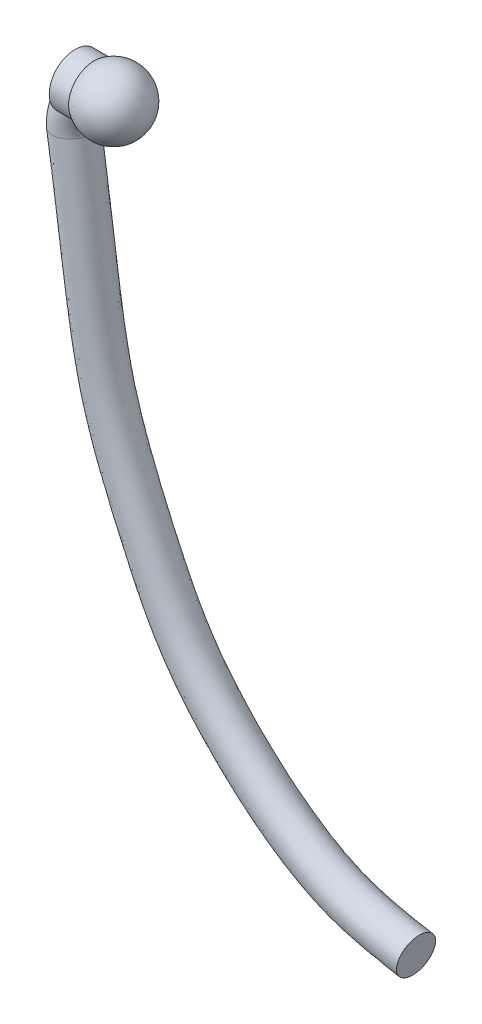
ISO-10303-21;
HEADER;
FILE_DESCRIPTION(('STEP AP214'),'2;1');
FILE_NAME('part.step','',(''),(''),'','','');
FILE_SCHEMA(('AUTOMOTIVE_DESIGN { 1 0 10303 214 1 1 1 1 }'));
ENDSEC;
DATA;
#1=APPLICATION_CONTEXT('core data for automotive mechanical design processes');
#2=APPLICATION_PROTOCOL_DEFINITION('international standard','automotive_design',2000,#1);
#3=PRODUCT_CONTEXT('',#1,'mechanical');
#4=PRODUCT('Part','Part','',(#3));
#5=PRODUCT_RELATED_PRODUCT_CATEGORY('part','',(#4));
#6=PRODUCT_DEFINITION_FORMATION('','',#4);
#7=PRODUCT_DEFINITION_CONTEXT('part definition',#1,'design');
#8=PRODUCT_DEFINITION('design','',#6,#7);
#9=PRODUCT_DEFINITION_SHAPE('','',#8);
#10=(LENGTH_UNIT() NAMED_UNIT(*) SI_UNIT(.MILLI.,.METRE.));
#11=(NAMED_UNIT(*) PLANE_ANGLE_UNIT() SI_UNIT($,.RADIAN.));
#12=(NAMED_UNIT(*) SI_UNIT($,.STERADIAN.) SOLID_ANGLE_UNIT());
#13=UNCERTAINTY_MEASURE_WITH_UNIT(LENGTH_MEASURE(1.E-05),#10,'distance_accuracy_value','');
#14=(GEOMETRIC_REPRESENTATION_CONTEXT(3) GLOBAL_UNCERTAINTY_ASSIGNED_CONTEXT((#13)) GLOBAL_UNIT_ASSIGNED_CONTEXT((#10,
#11,#12)) REPRESENTATION_CONTEXT('',''));
#15=CARTESIAN_POINT('',(0.,0.,0.));
#16=DIRECTION('',(0.,0.,1.));
#17=DIRECTION('',(1.,0.,0.));
#18=AXIS2_PLACEMENT_3D('',#15,#16,#17);
#19=CARTESIAN_POINT('',(-0.0106926166099035,0.,-0.15));
#20=CARTESIAN_POINT('',(-0.0274696503355554,0.,-0.15));
#21=CARTESIAN_POINT('',(-0.0601594618193001,-0.00304024673754914,-0.15));
#22=CARTESIAN_POINT('',(-0.11357903975813,-0.0174072750003002,-0.15));
#23=CARTESIAN_POINT('',(-0.163959337655345,-0.040864326922888,-0.15));
#24=CARTESIAN_POINT('',(-0.210750071659686,-0.0740666282199939,-0.15));
#25=CARTESIAN_POINT('',(-0.247646717062509,-0.113236952224477,-0.15));
#26=CARTESIAN_POINT('',(-0.277855380696539,-0.161394430237348,-0.15));
#27=CARTESIAN_POINT('',(-0.298187605453956,-0.211953645073237,-0.15));
#28=CARTESIAN_POINT('',(-0.309623406786862,-0.264715976755664,-0.15));
#29=CARTESIAN_POINT('',(-0.311129569039642,-0.297025149708893,-0.15));
#30=CARTESIAN_POINT('',(-0.31038974592792,-0.313477042648187,-0.15));
#31=CARTESIAN_POINT('',(-0.0106926166099035,0.3,-0.15));
#32=CARTESIAN_POINT('',(-0.0274696503355554,0.3,-0.15));
#33=CARTESIAN_POINT('',(-0.125351922333396,0.293260602950491,-0.15));
#34=CARTESIAN_POINT('',(-0.218277020498136,0.264437042215253,-0.15));
#35=CARTESIAN_POINT('',(-0.320307921228764,0.217669897199567,-0.15));
#36=CARTESIAN_POINT('',(-0.414103780964583,0.149427702048361,-0.15));
#37=CARTESIAN_POINT('',(-0.492748355596244,0.0634662388382427,-0.15));
#38=CARTESIAN_POINT('',(-0.55211438170516,-0.0344868074002096,-0.15));
#39=CARTESIAN_POINT('',(-0.589812372961597,-0.137857370007301,-0.15));
#40=CARTESIAN_POINT('',(-0.611320534229493,-0.23046459167502,-0.15));
#41=CARTESIAN_POINT('',(-0.610076906112513,-0.327175774931569,-0.15));
#42=CARTESIAN_POINT('',(-0.609337083000791,-0.343627667870862,-0.15));
#43=CARTESIAN_POINT('',(-0.0106926166099035,0.3,0.15));
#44=CARTESIAN_POINT('',(-0.0274696503355554,0.3,0.15));
#45=CARTESIAN_POINT('',(-0.125351922333396,0.293260602950491,0.15));
#46=CARTESIAN_POINT('',(-0.218277020498136,0.264437042215253,0.15));
#47=CARTESIAN_POINT('',(-0.320307921228764,0.217669897199567,0.15));
#48=CARTESIAN_POINT('',(-0.414103780964583,0.149427702048361,0.15));
#49=CARTESIAN_POINT('',(-0.492748355596244,0.0634662388382427,0.15));
#50=CARTESIAN_POINT('',(-0.55211438170516,-0.0344868074002096,0.15));
#51=CARTESIAN_POINT('',(-0.589812372961597,-0.137857370007301,0.15));
#52=CARTESIAN_POINT('',(-0.611320534229493,-0.23046459167502,0.15));
#53=CARTESIAN_POINT('',(-0.610076906112513,-0.327175774931569,0.15));
#54=CARTESIAN_POINT('',(-0.609337083000791,-0.343627667870862,0.15));
#55=CARTESIAN_POINT('',(-0.0106926166099035,0.,0.15));
#56=CARTESIAN_POINT('',(-0.0274696503355554,0.,0.15));
#57=CARTESIAN_POINT('',(-0.0601594618193001,-0.00304024673754912,0.15));
#58=CARTESIAN_POINT('',(-0.11357903975813,-0.0174072750003002,0.15));
#59=CARTESIAN_POINT('',(-0.163959337655345,-0.040864326922888,0.15));
#60=CARTESIAN_POINT('',(-0.210750071659686,-0.0740666282199939,0.15));
#61=CARTESIAN_POINT('',(-0.247646717062509,-0.113236952224477,0.15));
#62=CARTESIAN_POINT('',(-0.27785538069654,-0.161394430237348,0.15));
#63=CARTESIAN_POINT('',(-0.298187605453956,-0.211953645073238,0.15));
#64=CARTESIAN_POINT('',(-0.309623406786862,-0.264715976755664,0.15));
#65=CARTESIAN_POINT('',(-0.311129569039642,-0.297025149708893,0.15));
#66=CARTESIAN_POINT('',(-0.31038974592792,-0.313477042648187,0.15));
#67=CARTESIAN_POINT('',(-0.0106926166099035,-0.3,0.15));
#68=CARTESIAN_POINT('',(-0.0274696503355554,-0.3,0.15));
#69=CARTESIAN_POINT('',(0.00503299869479531,-0.299341096425589,0.15));
#70=CARTESIAN_POINT('',(-0.00888105901812529,-0.299251592215854,0.15));
#71=CARTESIAN_POINT('',(-0.00761075408192601,-0.299398551045343,0.15));
#72=CARTESIAN_POINT('',(-0.00739636235478842,-0.297560958488348,0.15));
#73=CARTESIAN_POINT('',(-0.00254507852877501,-0.289940143287197,0.15));
#74=CARTESIAN_POINT('',(-0.00359637968791915,-0.288302053074486,0.15));
#75=CARTESIAN_POINT('',(-0.00656283794631473,-0.286049920139174,0.15));
#76=CARTESIAN_POINT('',(-0.00792627934423149,-0.298967361836307,0.15));
#77=CARTESIAN_POINT('',(-0.0121822319667709,-0.266874524486218,0.15));
#78=CARTESIAN_POINT('',(-0.0114424088550488,-0.283326417425511,0.15));
#79=CARTESIAN_POINT('',(-0.0106926166099035,-0.3,-0.15));
#80=CARTESIAN_POINT('',(-0.0274696503355554,-0.3,-0.15));
#81=CARTESIAN_POINT('',(0.00503299869479531,-0.299341096425589,-0.15));
#82=CARTESIAN_POINT('',(-0.00888105901812529,-0.299251592215854,-0.15));
#83=CARTESIAN_POINT('',(-0.00761075408192601,-0.299398551045343,-0.15));
#84=CARTESIAN_POINT('',(-0.00739636235478842,-0.297560958488348,-0.15));
#85=CARTESIAN_POINT('',(-0.00254507852877501,-0.289940143287197,-0.15));
#86=CARTESIAN_POINT('',(-0.00359637968791915,-0.288302053074486,-0.15));
#87=CARTESIAN_POINT('',(-0.00656283794631473,-0.286049920139174,-0.15));
#88=CARTESIAN_POINT('',(-0.00792627934423149,-0.298967361836307,-0.15));
#89=CARTESIAN_POINT('',(-0.0121822319667709,-0.266874524486218,-0.15));
#90=CARTESIAN_POINT('',(-0.0114424088550488,-0.283326417425511,-0.15));
#91=CARTESIAN_POINT('',(-0.0106926166099035,0.,-0.15));
#92=CARTESIAN_POINT('',(-0.0274696503355554,0.,-0.15));
#93=CARTESIAN_POINT('',(-0.0601594618193001,-0.00304024673754914,-0.15));
#94=CARTESIAN_POINT('',(-0.11357903975813,-0.0174072750003002,-0.15));
#95=CARTESIAN_POINT('',(-0.163959337655345,-0.040864326922888,-0.15));
#96=CARTESIAN_POINT('',(-0.210750071659686,-0.0740666282199939,-0.15));
#97=CARTESIAN_POINT('',(-0.247646717062509,-0.113236952224477,-0.15));
#98=CARTESIAN_POINT('',(-0.277855380696539,-0.161394430237348,-0.15));
#99=CARTESIAN_POINT('',(-0.298187605453956,-0.211953645073237,-0.15));
#100=CARTESIAN_POINT('',(-0.309623406786862,-0.264715976755664,-0.15));
#101=CARTESIAN_POINT('',(-0.311129569039642,-0.297025149708893,-0.15));
#102=CARTESIAN_POINT('',(-0.31038974592792,-0.313477042648187,-0.15));
#103=(BOUNDED_SURFACE() B_SPLINE_SURFACE(3,3,((#19,#20,#21,#22,#23,#24,#25,#26,#27,#28,#29,#30),
(#31,#32,#33,#34,#35,#36,#37,#38,#39,#40,#41,#42),(#43,#44,#45,#46,#47,#48,#49,#50,#51,#52,#53,
#54),(#55,#56,#57,#58,#59,#60,#61,#62,#63,#64,#65,#66),(#67,#68,#69,#70,#71,#72,#73,#74,#75,#76,
#77,#78),(#79,#80,#81,#82,#83,#84,#85,#86,#87,#88,#89,#90),(#91,#92,#93,#94,#95,#96,#97,#98,#99,
#100,#101,#102)),.UNSPECIFIED.,.T.,.F.,.F.) B_SPLINE_SURFACE_WITH_KNOTS((4,3,4),(4,1,1,1,1,1,1,
1,1,4),(0.,0.5,1.),(0.,0.107382273943545,0.214616989416298,0.325775449425742,0.442043019539431,
0.564335874067141,0.67830105457525,0.787849250029312,0.894017072188608,1.),
.UNSPECIFIED.) GEOMETRIC_REPRESENTATION_ITEM() RATIONAL_B_SPLINE_SURFACE(((1.,1.,1.,1.,1.,1.,1.,
1.,1.,1.,1.,1.),(0.333333333333333,0.333333333333333,0.333333333333333,0.333333333333333,
0.333333333333333,0.333333333333333,0.333333333333333,0.333333333333333,0.333333333333333,
0.333333333333333,0.333333333333333,0.333333333333333),(0.333333333333333,0.333333333333333,
0.333333333333333,0.333333333333333,0.333333333333333,0.333333333333333,0.333333333333333,
0.333333333333333,0.333333333333333,0.333333333333333,0.333333333333333,0.333333333333333),(1.,
1.,1.,1.,1.,1.,1.,1.,1.,1.,1.,1.),(0.333333333333333,0.333333333333333,0.333333333333333,
0.333333333333333,0.333333333333333,0.333333333333333,0.333333333333333,0.333333333333333,
0.333333333333333,0.333333333333333,0.333333333333333,0.333333333333333),(0.333333333333333,
0.333333333333333,0.333333333333333,0.333333333333333,0.333333333333333,0.333333333333333,
0.333333333333333,0.333333333333333,0.333333333333333,0.333333333333333,0.333333333333333,
0.333333333333333),(1.,1.,1.,1.,1.,1.,1.,1.,1.,1.,1.,1.))) REPRESENTATION_ITEM('') SURFACE());
#104=CARTESIAN_POINT('',(-0.299999999999686,-0.136331714618667,-0.146334082123994));
#105=CARTESIAN_POINT('',(-0.290863642355465,-0.1345844554364,-0.147932075160637));
#106=CARTESIAN_POINT('',(-0.281473155448432,-0.13333300350285,-0.149064620614882));
#107=CARTESIAN_POINT('',(-0.262480914951277,-0.132101423752771,-0.150175426210611));
#108=CARTESIAN_POINT('',(-0.252878107870872,-0.13213085032023,-0.150145011755781));
#109=CARTESIAN_POINT('',(-0.236805394896345,-0.133524050109138,-0.148900335304193));
#110=CARTESIAN_POINT('',(-0.230275131621225,-0.134477181214744,-0.148050802120753));
#111=CARTESIAN_POINT('',(-0.217548317450747,-0.137144600250954,-0.145584356724694));
#112=CARTESIAN_POINT('',(-0.211350456705265,-0.138855609688366,-0.143970747761315));
#113=CARTESIAN_POINT('',(-0.199440453568951,-0.142935101415709,-0.139920065923362));
#114=CARTESIAN_POINT('',(-0.193729587577499,-0.145305246020314,-0.137480907623022));
#115=CARTESIAN_POINT('',(-0.182947003817764,-0.15049040939449,-0.131786489102963));
#116=CARTESIAN_POINT('',(-0.177876421414653,-0.153306199015514,-0.128529808951271));
#117=CARTESIAN_POINT('',(-0.163767358046019,-0.162010706360538,-0.117630141372031));
#118=CARTESIAN_POINT('',(-0.155771753537615,-0.168181282981623,-0.108837063650234));
#119=CARTESIAN_POINT('',(-0.141530953219301,-0.180319249944901,-0.0875051531757729));
#120=CARTESIAN_POINT('',(-0.135700066190499,-0.186131159628033,-0.0746103353626214));
#121=CARTESIAN_POINT('',(-0.126734767590223,-0.195397914471497,-0.0455461331270798));
#122=CARTESIAN_POINT('',(-0.123931264598526,-0.198556243935249,-0.0291777167104979));
#123=CARTESIAN_POINT('',(-0.122040965043913,-0.200664899609103,0.00422700781479089));
#124=CARTESIAN_POINT('',(-0.122998280074614,-0.199565285468028,0.0212689077692113));
#125=CARTESIAN_POINT('',(-0.12873488790736,-0.193318490578605,0.0538467821271335));
#126=CARTESIAN_POINT('',(-0.133495565343796,-0.188191025981588,0.069389679082215));
#127=CARTESIAN_POINT('',(-0.143674081929535,-0.178595967468044,0.0903627361064858));
#128=CARTESIAN_POINT('',(-0.147604174620646,-0.175054778167521,0.0969942583166261));
#129=CARTESIAN_POINT('',(-0.156581495506477,-0.167661841132851,0.109270909335789));
#130=CARTESIAN_POINT('',(-0.16162830451373,-0.163810210274718,0.114916406854791));
#131=CARTESIAN_POINT('',(-0.172568330976763,-0.156448976343672,0.12473781304649));
#132=CARTESIAN_POINT('',(-0.178398408423533,-0.152932293020231,0.12897826357668));
#133=CARTESIAN_POINT('',(-0.191023950773728,-0.146466206459085,0.136277345206562));
#134=CARTESIAN_POINT('',(-0.197817283360246,-0.143515583227051,0.139338532597072));
#135=CARTESIAN_POINT('',(-0.211052889556991,-0.138938059781777,0.14389307359331));
#136=CARTESIAN_POINT('',(-0.217392497122094,-0.137178356796567,0.145553666322049));
#137=CARTESIAN_POINT('',(-0.230392573291752,-0.134451466217067,0.148074054557085));
#138=CARTESIAN_POINT('',(-0.23705341671717,-0.133485229351444,0.148932889567748));
#139=CARTESIAN_POINT('',(-0.260155185809829,-0.131543575049926,0.150674429757816));
#140=CARTESIAN_POINT('',(-0.276927127524948,-0.132540899396995,0.149826195277144));
#141=CARTESIAN_POINT('',(-0.295369177011944,-0.135487376346327,0.147115696669723));
#142=CARTESIAN_POINT('',(-0.297693262089106,-0.135894159182839,0.146740033243813));
#143=CARTESIAN_POINT('',(-0.300000000000453,-0.136331714607611,0.146334082127661));
#144=B_SPLINE_CURVE_WITH_KNOTS('',3,(#104,#105,#106,#107,#108,#109,#110,#111,#112,#113,#114,
#115,#116,#117,#118,#119,#120,#121,#122,#123,#124,#125,#126,#127,#128,#129,#130,#131,#132,#133,
#134,#135,#136,#137,#138,#139,#140,#141,#142,#143),.UNSPECIFIED.,.F.,.F.,(4,2,2,2,2,2,2,2,2,2,2,
2,2,2,2,2,2,2,2,4),(0.,0.0284102410315837,0.0570324370138274,0.076905201082822,
0.0966928249385212,0.116530812216742,0.136403496898723,0.175954780231196,0.221166776870093,
0.27093448820308,0.321287670545221,0.371395900612978,0.396738218154183,0.422071038910645,
0.445986759201024,0.469850341642783,0.490099580924274,0.510373047525644,0.559711175412683,
0.566874718983783),.UNSPECIFIED.);
#145=CARTESIAN_POINT('',(-0.3,-0.136331714607295,-0.146334082127715));
#146=VERTEX_POINT('',#145);
#147=CARTESIAN_POINT('',(-0.150000000012057,-0.173103640726156,-0.100175493846298));
#148=VERTEX_POINT('',#147);
#149=EDGE_CURVE('E51',#146,#148,#144,.T.);
#150=CARTESIAN_POINT('',(-0.180136517374345,-0.0925858020005814,-0.146556147520844));
#151=CARTESIAN_POINT('',(-0.177160223821154,-0.101401341167023,-0.144654585464569));
#152=CARTESIAN_POINT('',(-0.174157711007457,-0.110034114792797,-0.141959487608441));
#153=CARTESIAN_POINT('',(-0.168186070119803,-0.126707136061684,-0.135086204395576));
#154=CARTESIAN_POINT('',(-0.16521696346823,-0.134747020021021,-0.130907117736933));
#155=CARTESIAN_POINT('',(-0.159400714868007,-0.149998802529904,-0.121170607602066));
#156=CARTESIAN_POINT('',(-0.156553618554732,-0.157210392939353,-0.115612673583984));
#157=CARTESIAN_POINT('',(-0.151090716745326,-0.170586789949842,-0.103257084253783));
#158=CARTESIAN_POINT('',(-0.14847490465238,-0.176751626411592,-0.0964594643176156));
#159=CARTESIAN_POINT('',(-0.143684755761816,-0.187690904806338,-0.0819345308792571));
#160=CARTESIAN_POINT('',(-0.141501994559982,-0.19249287621642,-0.0742308779340528));
#161=CARTESIAN_POINT('',(-0.137708220743359,-0.200654451295558,-0.057969102691995));
#162=CARTESIAN_POINT('',(-0.136096435360126,-0.20401600575184,-0.0494121555270982));
#163=CARTESIAN_POINT('',(-0.133760690732441,-0.208832365058485,-0.0326508050646556));
#164=CARTESIAN_POINT('',(-0.132961081301,-0.21045075113008,-0.0245042482683785));
#165=CARTESIAN_POINT('',(-0.132049211088169,-0.212291856116223,-0.00802626311988404));
#166=CARTESIAN_POINT('',(-0.131936507212364,-0.212515474739849,0.000305042576185881));
#167=CARTESIAN_POINT('',(-0.132622151981437,-0.211140668897883,0.0234897779742567));
#168=CARTESIAN_POINT('',(-0.134216927016438,-0.207950574099344,0.0382570971468304));
#169=CARTESIAN_POINT('',(-0.139219501213331,-0.197455421916017,0.0660434859777733));
#170=CARTESIAN_POINT('',(-0.142652854152421,-0.190092278434849,0.0790345928136093));
#171=CARTESIAN_POINT('',(-0.150874991864004,-0.171215513700673,0.10344929772172));
#172=CARTESIAN_POINT('',(-0.155768927609801,-0.159344458015269,0.114560411013672));
#173=CARTESIAN_POINT('',(-0.16398672602771,-0.138048480645966,0.12906632809329));
#174=CARTESIAN_POINT('',(-0.16719003728461,-0.129440245296472,0.133785108819291));
#175=CARTESIAN_POINT('',(-0.173648872055548,-0.111492852936654,0.141496711428997));
#176=CARTESIAN_POINT('',(-0.176904429968452,-0.10215319723065,0.14448834386941));
#177=CARTESIAN_POINT('',(-0.180136517374313,-0.0925858020006532,0.146556147520827));
#178=B_SPLINE_CURVE_WITH_KNOTS('',3,(#150,#151,#152,#153,#154,#155,#156,#157,#158,#159,#160,
#161,#162,#163,#164,#165,#166,#167,#168,#169,#170,#171,#172,#173,#174,#175,#176,#177),
.UNSPECIFIED.,.F.,.F.,(4,2,2,2,2,2,2,2,2,2,2,2,2,4),(0.,0.0284533264523951,0.0569239636982982,
0.0854051584601809,0.113885540603517,0.141741272990282,0.169559159607244,0.194446112144242,
0.219317009435058,0.263980980942915,0.309282475911664,0.359389710228695,0.390214189311538,
0.421059871187897),.UNSPECIFIED.);
#179=CARTESIAN_POINT('',(-0.15,-0.173103640736441,0.100175493828527));
#180=VERTEX_POINT('',#179);
#181=EDGE_CURVE('E74',#148,#180,#178,.T.);
#182=CARTESIAN_POINT('',(-0.3,-0.136331714607562,0.14633408212772));
#183=VERTEX_POINT('',#182);
#184=EDGE_CURVE('E68',#180,#183,#144,.T.);
#185=CARTESIAN_POINT('',(-0.300000000000014,-0.202399999999996,-0.149872930608669));
#186=CARTESIAN_POINT('',(-0.300000000000005,-0.191516033986441,-0.149724008710005));
#187=CARTESIAN_POINT('',(-0.300000000000001,-0.180626229349511,-0.149444190094314));
#188=CARTESIAN_POINT('',(-0.299999999999998,-0.158736438444456,-0.148370387069068));
#189=CARTESIAN_POINT('',(-0.299999999999999,-0.147736791999471,-0.147569970922332));
#190=CARTESIAN_POINT('',(-0.300000000000001,-0.121462501220942,-0.144723297355984));
#191=CARTESIAN_POINT('',(-0.300000000000001,-0.106219856070111,-0.142309207914083));
#192=CARTESIAN_POINT('',(-0.299999999999999,-0.0763376641470669,-0.135210866958877));
#193=CARTESIAN_POINT('',(-0.299999999999997,-0.0616949759905368,-0.13054071722933));
#194=CARTESIAN_POINT('',(-0.299999999999997,-0.0309224431226903,-0.116933205705473));
#195=CARTESIAN_POINT('',(-0.299999999999999,-0.0150529200228886,-0.107345098650147));
#196=CARTESIAN_POINT('',(-0.3,0.0104602091268992,-0.0849634923856717));
#197=CARTESIAN_POINT('',(-0.3,0.0206803698164261,-0.0728654217112565));
#198=CARTESIAN_POINT('',(-0.3,0.0323187817545215,-0.0525481811787304));
#199=CARTESIAN_POINT('',(-0.3,0.0355902240989634,-0.045370567061368));
#200=CARTESIAN_POINT('',(-0.3,0.0406827737780192,-0.0305221764960874));
#201=CARTESIAN_POINT('',(-0.3,0.0425049634587401,-0.0228517727144995));
#202=CARTESIAN_POINT('',(-0.3,0.0452873346196284,-0.00155182705056789));
#203=CARTESIAN_POINT('',(-0.3,0.0446377801373459,0.0123262720306305));
#204=CARTESIAN_POINT('',(-0.3,0.0387667218811681,0.0383326679143764));
#205=CARTESIAN_POINT('',(-0.3,0.0337576335029705,0.0505121638981799));
#206=CARTESIAN_POINT('',(-0.3,0.0199907114066975,0.0734569428442876));
#207=CARTESIAN_POINT('',(-0.3,0.0110322733706816,0.0840992049388013));
#208=CARTESIAN_POINT('',(-0.3,-0.00639614000302605,0.0999546178537227));
#209=CARTESIAN_POINT('',(-0.3,-0.0142778154451443,0.105850666588182));
#210=CARTESIAN_POINT('',(-0.3,-0.0308961243243771,0.116292775230428));
#211=CARTESIAN_POINT('',(-0.299999999999999,-0.0396338755943888,0.120837037933269));
#212=CARTESIAN_POINT('',(-0.3,-0.0623283256424644,0.130734406183284));
#213=CARTESIAN_POINT('',(-0.300000000000003,-0.0766327006247933,0.135275812226016));
#214=CARTESIAN_POINT('',(-0.299999999999997,-0.10577981238435,0.142209830632203));
#215=CARTESIAN_POINT('',(-0.299999999999987,-0.120624981666207,0.144591034565171));
#216=CARTESIAN_POINT('',(-0.299999999999989,-0.146703223719817,0.14748615628219));
#217=CARTESIAN_POINT('',(-0.299999999999995,-0.157906015163985,0.148319033671786));
#218=CARTESIAN_POINT('',(-0.300000000000005,-0.180209023488198,0.149433497550648));
#219=CARTESIAN_POINT('',(-0.300000000000007,-0.191308897469137,0.149721451562793));
#220=CARTESIAN_POINT('',(-0.3,-0.2024,0.14987293060867));
#221=B_SPLINE_CURVE_WITH_KNOTS('',3,(#185,#186,#187,#188,#189,#190,#191,#192,#193,#194,#195,
#196,#197,#198,#199,#200,#201,#202,#203,#204,#205,#206,#207,#208,#209,#210,#211,#212,#213,#214,
#215,#216,#217,#218,#219,#220),.UNSPECIFIED.,.F.,.F.,(4,2,2,2,2,2,2,2,2,2,2,2,2,2,2,2,2,4),(0.,
0.0326643470981506,0.065740115030189,0.111913721483177,0.157802376917121,0.212568633766917,
0.259129974713748,0.282659087848952,0.306170612180547,0.346908373524943,0.385765766163569,
0.426877226898047,0.456273144316685,0.485707970824875,0.530475398434666,0.575477897660362,
0.609165383231217,0.642456733950464),.UNSPECIFIED.);
#222=EDGE_CURVE('E63',#146,#183,#221,.T.);
#223=CARTESIAN_POINT('',(-0.31038974592792,-0.313477042648187,-0.15));
#224=CARTESIAN_POINT('',(-0.609337083000791,-0.343627667870862,-0.15));
#225=CARTESIAN_POINT('',(-0.609337083000791,-0.343627667870862,0.15));
#226=CARTESIAN_POINT('',(-0.31038974592792,-0.313477042648187,0.15));
#227=CARTESIAN_POINT('',(-0.0114424088550488,-0.283326417425511,0.15));
#228=CARTESIAN_POINT('',(-0.0114424088550488,-0.283326417425511,-0.15));
#229=CARTESIAN_POINT('',(-0.31038974592792,-0.313477042648187,-0.15));
#230=(BOUNDED_CURVE() B_SPLINE_CURVE(3,(#223,#224,#225,#226,#227,#228,#229),.UNSPECIFIED.,.T.,
.F.) B_SPLINE_CURVE_WITH_KNOTS((4,3,4),(0.,0.5,1.),
.UNSPECIFIED.) CURVE() GEOMETRIC_REPRESENTATION_ITEM() RATIONAL_B_SPLINE_CURVE((1.,
0.333333333333333,0.333333333333333,1.,0.333333333333333,0.333333333333333,1.)) REPRESENTATION_ITEM(''));
#231=CARTESIAN_POINT('',(-0.31038974592792,-0.313477042648187,-0.15));
#232=VERTEX_POINT('',#231);
#233=EDGE_CURVE('E120',#232,#232,#230,.F.);
#234=ORIENTED_EDGE('',*,*,#149,.T.);
#235=ORIENTED_EDGE('',*,*,#181,.T.);
#236=ORIENTED_EDGE('',*,*,#184,.T.);
#237=ORIENTED_EDGE('',*,*,#222,.F.);
#238=EDGE_LOOP('',(#234,#235,#236,#237));
#239=FACE_BOUND('',#238,.T.);
#240=ORIENTED_EDGE('',*,*,#233,.F.);
#241=EDGE_LOOP('',(#240));
#242=FACE_BOUND('',#241,.T.);
#243=ADVANCED_FACE('F41',(#239,#242),#103,.F.);
#244=CARTESIAN_POINT('',(2.3527600676174,-4.57315667423586,0.15));
#245=DIRECTION('',(-0.98480775301221,0.173648177666921,0.));
#246=DIRECTION('',(-0.173648177666921,-0.98480775301221,0.));
#247=AXIS2_PLACEMENT_3D('',#244,#245,#246);
#248=PLANE('',#247);
#249=CARTESIAN_POINT('',(2.3527600676174,-4.57315667423586,0.));
#250=DIRECTION('',(-0.98480775301221,0.17364817766692,0.));
#251=DIRECTION('',(-0.17364817766692,-0.98480775301221,0.));
#252=AXIS2_PLACEMENT_3D('',#249,#250,#251);
#253=CIRCLE('',#252,0.15);
#254=CARTESIAN_POINT('',(2.32671284096736,-4.72087783718769,0.));
#255=VERTEX_POINT('',#254);
#256=EDGE_CURVE('E125',#255,#255,#253,.T.);
#257=ORIENTED_EDGE('',*,*,#256,.F.);
#258=EDGE_LOOP('',(#257));
#259=FACE_BOUND('',#258,.T.);
#260=ADVANCED_FACE('F89',(#259),#248,.F.);
#261=CARTESIAN_POINT('',(-0.31038974592792,-0.313477042648186,-0.15));
#262=CARTESIAN_POINT('',(-0.262459918902544,-0.618037457266047,-0.15));
#263=CARTESIAN_POINT('',(-0.187072577065262,-1.1838230792682,-0.15));
#264=CARTESIAN_POINT('',(-0.0611788565120319,-2.01689830560629,-0.15));
#265=CARTESIAN_POINT('',(0.240453241218438,-2.73657842153339,-0.15));
#266=CARTESIAN_POINT('',(0.537031572229338,-3.37168427289845,-0.15));
#267=CARTESIAN_POINT('',(0.948036632054944,-3.84462864550806,-0.15));
#268=CARTESIAN_POINT('',(1.35414203367245,-4.20193513950461,-0.15));
#269=CARTESIAN_POINT('',(1.82735401601363,-4.4759190733248,-0.15));
#270=CARTESIAN_POINT('',(2.17377549104406,-4.54159686425531,-0.15));
#271=CARTESIAN_POINT('',(2.3527600676174,-4.57315667423586,-0.15));
#272=CARTESIAN_POINT('',(-0.0114424088550488,-0.283326417425511,-0.15));
#273=CARTESIAN_POINT('',(0.0364874181703267,-0.587886832043372,-0.15));
#274=CARTESIAN_POINT('',(0.114622027861567,-1.17396948669902,-0.15));
#275=CARTESIAN_POINT('',(0.230305186256041,-1.93937291834671,-0.15));
#276=CARTESIAN_POINT('',(0.524200015331972,-2.63530052551327,-0.15));
#277=CARTESIAN_POINT('',(0.793603270459837,-3.21123026073958,-0.15));
#278=CARTESIAN_POINT('',(1.16711896472439,-3.63767800107697,-0.15));
#279=CARTESIAN_POINT('',(1.53639281355832,-3.96106647171765,-0.15));
#280=CARTESIAN_POINT('',(1.94172680037977,-4.19316498612246,-0.15));
#281=CARTESIAN_POINT('',(2.22586994434414,-4.24615453835164,-0.15));
#282=CARTESIAN_POINT('',(2.40485452091747,-4.2777143483322,-0.15));
#283=CARTESIAN_POINT('',(-0.0114424088550488,-0.283326417425511,0.15));
#284=CARTESIAN_POINT('',(0.0364874181703267,-0.587886832043372,0.15));
#285=CARTESIAN_POINT('',(0.114622027861567,-1.17396948669902,0.15));
#286=CARTESIAN_POINT('',(0.230305186256041,-1.93937291834671,0.15));
#287=CARTESIAN_POINT('',(0.524200015331972,-2.63530052551327,0.15));
#288=CARTESIAN_POINT('',(0.793603270459837,-3.21123026073958,0.15));
#289=CARTESIAN_POINT('',(1.16711896472439,-3.63767800107697,0.15));
#290=CARTESIAN_POINT('',(1.53639281355832,-3.96106647171765,0.15));
#291=CARTESIAN_POINT('',(1.94172680037977,-4.19316498612246,0.15));
#292=CARTESIAN_POINT('',(2.22586994434414,-4.24615453835164,0.15));
#293=CARTESIAN_POINT('',(2.40485452091747,-4.2777143483322,0.15));
#294=CARTESIAN_POINT('',(-0.31038974592792,-0.313477042648186,0.15));
#295=CARTESIAN_POINT('',(-0.262459918902544,-0.618037457266047,0.15));
#296=CARTESIAN_POINT('',(-0.187072577065262,-1.1838230792682,0.15));
#297=CARTESIAN_POINT('',(-0.0611788565120319,-2.01689830560629,0.15));
#298=CARTESIAN_POINT('',(0.240453241218438,-2.73657842153339,0.15));
#299=CARTESIAN_POINT('',(0.537031572229338,-3.37168427289845,0.15));
#300=CARTESIAN_POINT('',(0.948036632054944,-3.84462864550806,0.15));
#301=CARTESIAN_POINT('',(1.35414203367245,-4.20193513950461,0.15));
#302=CARTESIAN_POINT('',(1.82735401601363,-4.4759190733248,0.15));
#303=CARTESIAN_POINT('',(2.17377549104406,-4.54159686425531,0.15));
#304=CARTESIAN_POINT('',(2.3527600676174,-4.57315667423586,0.15));
#305=CARTESIAN_POINT('',(-0.609337083000791,-0.343627667870862,0.15));
#306=CARTESIAN_POINT('',(-0.561407255975415,-0.648188082488722,0.15));
#307=CARTESIAN_POINT('',(-0.48876718199209,-1.19367667183737,0.15));
#308=CARTESIAN_POINT('',(-0.352662899280104,-2.09442369286586,0.15));
#309=CARTESIAN_POINT('',(-0.0432935328950962,-2.83785631755352,0.15));
#310=CARTESIAN_POINT('',(0.28045987399884,-3.53213828505732,0.15));
#311=CARTESIAN_POINT('',(0.728954299385499,-4.05157928993915,0.15));
#312=CARTESIAN_POINT('',(1.17189125378658,-4.44280380729155,0.15));
#313=CARTESIAN_POINT('',(1.7129812316475,-4.75867316052715,0.15));
#314=CARTESIAN_POINT('',(2.12168103774398,-4.83703919015897,0.15));
#315=CARTESIAN_POINT('',(2.30066561431732,-4.86859900013953,0.15));
#316=CARTESIAN_POINT('',(-0.609337083000791,-0.343627667870862,-0.15));
#317=CARTESIAN_POINT('',(-0.561407255975415,-0.648188082488722,-0.15));
#318=CARTESIAN_POINT('',(-0.48876718199209,-1.19367667183737,-0.15));
#319=CARTESIAN_POINT('',(-0.352662899280104,-2.09442369286586,-0.15));
#320=CARTESIAN_POINT('',(-0.0432935328950962,-2.83785631755352,-0.15));
#321=CARTESIAN_POINT('',(0.28045987399884,-3.53213828505732,-0.15));
#322=CARTESIAN_POINT('',(0.728954299385499,-4.05157928993915,-0.15));
#323=CARTESIAN_POINT('',(1.17189125378658,-4.44280380729155,-0.15));
#324=CARTESIAN_POINT('',(1.7129812316475,-4.75867316052715,-0.15));
#325=CARTESIAN_POINT('',(2.12168103774398,-4.83703919015897,-0.15));
#326=CARTESIAN_POINT('',(2.30066561431732,-4.86859900013953,-0.15));
#327=CARTESIAN_POINT('',(-0.31038974592792,-0.313477042648186,-0.15));
#328=CARTESIAN_POINT('',(-0.262459918902544,-0.618037457266047,-0.15));
#329=CARTESIAN_POINT('',(-0.187072577065262,-1.1838230792682,-0.15));
#330=CARTESIAN_POINT('',(-0.0611788565120319,-2.01689830560629,-0.15));
#331=CARTESIAN_POINT('',(0.240453241218438,-2.73657842153339,-0.15));
#332=CARTESIAN_POINT('',(0.537031572229338,-3.37168427289845,-0.15));
#333=CARTESIAN_POINT('',(0.948036632054944,-3.84462864550806,-0.15));
#334=CARTESIAN_POINT('',(1.35414203367245,-4.20193513950461,-0.15));
#335=CARTESIAN_POINT('',(1.82735401601363,-4.4759190733248,-0.15));
#336=CARTESIAN_POINT('',(2.17377549104406,-4.54159686425531,-0.15));
#337=CARTESIAN_POINT('',(2.3527600676174,-4.57315667423586,-0.15));
#338=(BOUNDED_SURFACE() B_SPLINE_SURFACE(3,3,((#261,#262,#263,#264,#265,#266,#267,#268,#269,
#270,#271),(#272,#273,#274,#275,#276,#277,#278,#279,#280,#281,#282),(#283,#284,#285,#286,#287,
#288,#289,#290,#291,#292,#293),(#294,#295,#296,#297,#298,#299,#300,#301,#302,#303,#304),(#305,
#306,#307,#308,#309,#310,#311,#312,#313,#314,#315),(#316,#317,#318,#319,#320,#321,#322,#323,
#324,#325,#326),(#327,#328,#329,#330,#331,#332,#333,#334,#335,#336,#337)),.UNSPECIFIED.,.T.,.F.,
.F.) B_SPLINE_SURFACE_WITH_KNOTS((4,3,4),(4,1,1,1,1,1,1,1,4),(0.,0.5,1.),(0.,0.170575118923448,
0.316448346719232,0.463387193349166,0.600674045189018,0.701660776583312,0.807296568283887,
0.899446737330078,1.),
.UNSPECIFIED.) GEOMETRIC_REPRESENTATION_ITEM() RATIONAL_B_SPLINE_SURFACE(((1.,1.,1.,1.,1.,1.,1.,
1.,1.,1.,1.),(0.333333333333333,0.333333333333333,0.333333333333333,0.333333333333333,
0.333333333333333,0.333333333333333,0.333333333333333,0.333333333333333,0.333333333333333,
0.333333333333333,0.333333333333333),(0.333333333333333,0.333333333333333,0.333333333333333,
0.333333333333333,0.333333333333333,0.333333333333333,0.333333333333333,0.333333333333333,
0.333333333333333,0.333333333333333,0.333333333333333),(1.,1.,1.,1.,1.,1.,1.,1.,1.,1.,1.),
(0.333333333333333,0.333333333333333,0.333333333333333,0.333333333333333,0.333333333333333,
0.333333333333333,0.333333333333333,0.333333333333333,0.333333333333333,0.333333333333333,
0.333333333333333),(0.333333333333333,0.333333333333333,0.333333333333333,0.333333333333333,
0.333333333333333,0.333333333333333,0.333333333333333,0.333333333333333,0.333333333333333,
0.333333333333333,0.333333333333333),(1.,1.,1.,1.,1.,1.,1.,1.,1.,1.,1.))) REPRESENTATION_ITEM('') SURFACE());
#339=ORIENTED_EDGE('',*,*,#233,.T.);
#340=EDGE_LOOP('',(#339));
#341=FACE_BOUND('',#340,.T.);
#342=ORIENTED_EDGE('',*,*,#256,.T.);
#343=EDGE_LOOP('',(#342));
#344=FACE_BOUND('',#343,.T.);
#345=ADVANCED_FACE('F93',(#341,#344),#338,.T.);
#346=CARTESIAN_POINT('',(-0.3,0.,0.));
#347=DIRECTION('',(1.,0.,0.));
#348=DIRECTION('',(0.,0.,-1.));
#349=AXIS2_PLACEMENT_3D('',#346,#347,#348);
#350=CYLINDRICAL_SURFACE('',#349,0.2);
#351=CARTESIAN_POINT('',(-0.15,0.,0.));
#352=DIRECTION('',(1.,0.,0.));
#353=DIRECTION('',(0.,0.,-1.));
#354=AXIS2_PLACEMENT_3D('',#351,#352,#353);
#355=CIRCLE('',#354,0.2);
#356=EDGE_CURVE('E12',#148,#180,#355,.T.);
#357=ORIENTED_EDGE('',*,*,#356,.F.);
#358=ORIENTED_EDGE('',*,*,#149,.F.);
#359=CARTESIAN_POINT('',(-0.3,0.,0.));
#360=DIRECTION('',(1.,0.,0.));
#361=DIRECTION('',(0.,0.,-1.));
#362=AXIS2_PLACEMENT_3D('',#359,#360,#361);
#363=CIRCLE('',#362,0.2);
#364=EDGE_CURVE('E72',#146,#183,#363,.T.);
#365=ORIENTED_EDGE('',*,*,#364,.T.);
#366=ORIENTED_EDGE('',*,*,#184,.F.);
#367=EDGE_LOOP('',(#357,#358,#365,#366));
#368=FACE_BOUND('',#367,.T.);
#369=ADVANCED_FACE('F70',(#368),#350,.T.);
#370=CARTESIAN_POINT('',(-0.3,0.,0.));
#371=DIRECTION('',(1.,0.,0.));
#372=DIRECTION('',(0.,0.,-1.));
#373=AXIS2_PLACEMENT_3D('',#370,#371,#372);
#374=PLANE('',#373);
#375=ORIENTED_EDGE('',*,*,#364,.F.);
#376=ORIENTED_EDGE('',*,*,#222,.T.);
#377=EDGE_LOOP('',(#375,#376));
#378=FACE_BOUND('',#377,.T.);
#379=ADVANCED_FACE('F80',(#378),#374,.F.);
#380=CARTESIAN_POINT('',(0.,0.,0.));
#381=DIRECTION('',(0.,1.,0.));
#382=DIRECTION('',(0.,0.,-1.));
#383=AXIS2_PLACEMENT_3D('',#380,#381,#382);
#384=SPHERICAL_SURFACE('',#383,0.25);
#385=ORIENTED_EDGE('',*,*,#181,.F.);
#386=ORIENTED_EDGE('',*,*,#356,.T.);
#387=EDGE_LOOP('',(#385,#386));
#388=FACE_BOUND('',#387,.T.);
#389=ADVANCED_FACE('F78',(#388),#384,.T.);
#390=CLOSED_SHELL('',(#243,#260,#345,#369,#379,#389));
#391=MANIFOLD_SOLID_BREP('B2',#390);
#392=ADVANCED_BREP_SHAPE_REPRESENTATION('',(#18,#391),#14);
#393=SHAPE_DEFINITION_REPRESENTATION(#9,#392);
ENDSEC;
END-ISO-10303-21;
